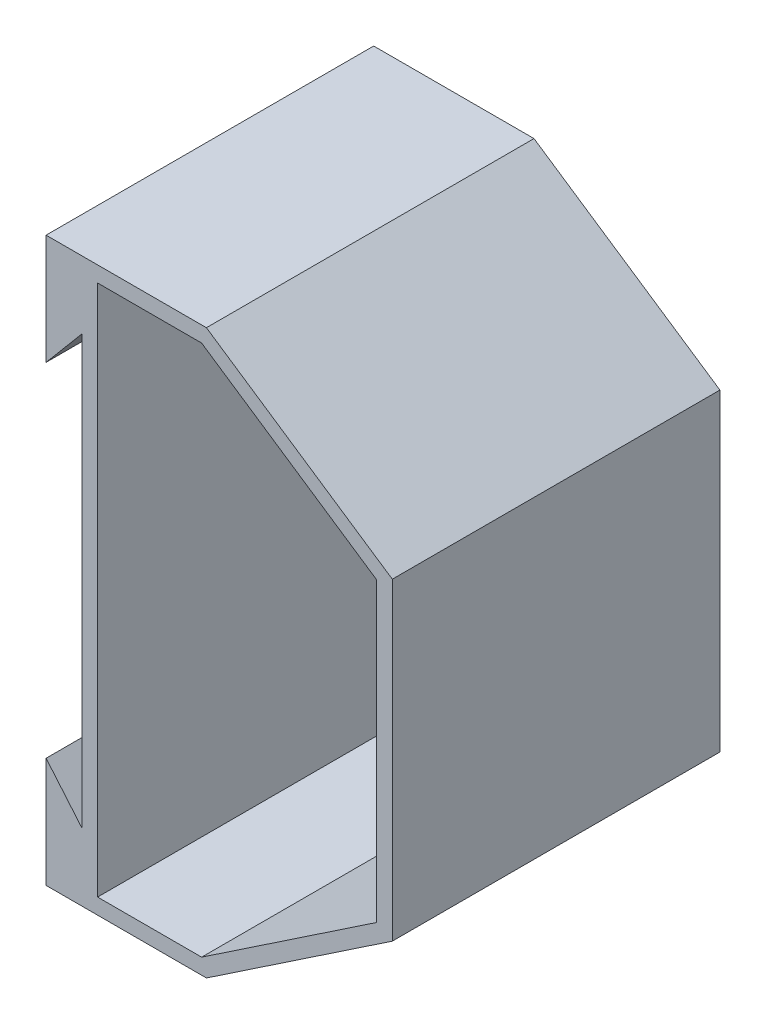
ISO-10303-21;
HEADER;
FILE_DESCRIPTION(('STEP AP214'),'2;1');
FILE_NAME('part.step','',(''),(''),'','','');
FILE_SCHEMA(('AUTOMOTIVE_DESIGN { 1 0 10303 214 1 1 1 1 }'));
ENDSEC;
DATA;
#1=APPLICATION_CONTEXT('core data for automotive mechanical design processes');
#2=APPLICATION_PROTOCOL_DEFINITION('international standard','automotive_design',2000,#1);
#3=PRODUCT_CONTEXT('',#1,'mechanical');
#4=PRODUCT('Part','Part','',(#3));
#5=PRODUCT_RELATED_PRODUCT_CATEGORY('part','',(#4));
#6=PRODUCT_DEFINITION_FORMATION('','',#4);
#7=PRODUCT_DEFINITION_CONTEXT('part definition',#1,'design');
#8=PRODUCT_DEFINITION('design','',#6,#7);
#9=PRODUCT_DEFINITION_SHAPE('','',#8);
#10=(LENGTH_UNIT() NAMED_UNIT(*) SI_UNIT(.MILLI.,.METRE.));
#11=(NAMED_UNIT(*) PLANE_ANGLE_UNIT() SI_UNIT($,.RADIAN.));
#12=(NAMED_UNIT(*) SI_UNIT($,.STERADIAN.) SOLID_ANGLE_UNIT());
#13=UNCERTAINTY_MEASURE_WITH_UNIT(LENGTH_MEASURE(1.E-05),#10,'distance_accuracy_value','');
#14=(GEOMETRIC_REPRESENTATION_CONTEXT(3) GLOBAL_UNCERTAINTY_ASSIGNED_CONTEXT((#13)) GLOBAL_UNIT_ASSIGNED_CONTEXT((#10,
#11,#12)) REPRESENTATION_CONTEXT('',''));
#15=CARTESIAN_POINT('',(0.,0.,0.));
#16=DIRECTION('',(0.,0.,1.));
#17=DIRECTION('',(1.,0.,0.));
#18=AXIS2_PLACEMENT_3D('',#15,#16,#17);
#19=CARTESIAN_POINT('',(0.,0.,73.15));
#20=DIRECTION('',(0.,0.,-1.));
#21=DIRECTION('',(-1.,0.,0.));
#22=AXIS2_PLACEMENT_3D('',#19,#20,#21);
#23=PLANE('',#22);
#24=DIRECTION('',(0.,1.,0.));
#25=VECTOR('',#24,1.);
#26=CARTESIAN_POINT('',(154.617693897145,70.,73.15));
#27=LINE('',#26,#25);
#28=CARTESIAN_POINT('',(154.617693897145,-70.,73.15));
#29=VERTEX_POINT('',#28);
#30=CARTESIAN_POINT('',(154.617693897145,70.,73.15));
#31=VERTEX_POINT('',#30);
#32=EDGE_CURVE('E205',#29,#31,#27,.T.);
#33=ORIENTED_EDGE('',*,*,#32,.T.);
#34=DIRECTION('',(-0.830176938971446,0.5575,0.));
#35=VECTOR('',#34,1.);
#36=CARTESIAN_POINT('',(154.617693897145,70.,73.15));
#37=LINE('',#36,#35);
#38=CARTESIAN_POINT('',(71.6,125.75,73.15));
#39=VERTEX_POINT('',#38);
#40=EDGE_CURVE('E208',#31,#39,#37,.T.);
#41=ORIENTED_EDGE('',*,*,#40,.T.);
#42=DIRECTION('',(-1.,0.,0.));
#43=VECTOR('',#42,1.);
#44=CARTESIAN_POINT('',(71.6,125.75,73.15));
#45=LINE('',#44,#43);
#46=CARTESIAN_POINT('',(0.,125.75,73.15));
#47=VERTEX_POINT('',#46);
#48=EDGE_CURVE('E211',#39,#47,#45,.T.);
#49=ORIENTED_EDGE('',*,*,#48,.T.);
#50=DIRECTION('',(0.,-1.,0.));
#51=VECTOR('',#50,1.);
#52=CARTESIAN_POINT('',(0.,125.75,73.15));
#53=LINE('',#52,#51);
#54=CARTESIAN_POINT('',(0.,76.55,73.15));
#55=VERTEX_POINT('',#54);
#56=EDGE_CURVE('E213',#47,#55,#53,.T.);
#57=ORIENTED_EDGE('',*,*,#56,.T.);
#58=DIRECTION('',(0.64413574578278,0.764911198117051,0.));
#59=VECTOR('',#58,1.);
#60=CARTESIAN_POINT('',(0.,76.55,73.15));
#61=LINE('',#60,#59);
#62=CARTESIAN_POINT('',(16.,95.55,73.15));
#63=VERTEX_POINT('',#62);
#64=EDGE_CURVE('E215',#55,#63,#61,.T.);
#65=ORIENTED_EDGE('',*,*,#64,.T.);
#66=DIRECTION('',(0.,-1.,0.));
#67=VECTOR('',#66,1.);
#68=CARTESIAN_POINT('',(16.,95.55,73.15));
#69=LINE('',#68,#67);
#70=CARTESIAN_POINT('',(16.,-95.55,73.15));
#71=VERTEX_POINT('',#70);
#72=EDGE_CURVE('E217',#63,#71,#69,.T.);
#73=ORIENTED_EDGE('',*,*,#72,.T.);
#74=DIRECTION('',(-0.64413574578278,0.764911198117051,0.));
#75=VECTOR('',#74,1.);
#76=CARTESIAN_POINT('',(0.,-76.55,73.15));
#77=LINE('',#76,#75);
#78=CARTESIAN_POINT('',(0.,-76.55,73.15));
#79=VERTEX_POINT('',#78);
#80=EDGE_CURVE('E219',#71,#79,#77,.T.);
#81=ORIENTED_EDGE('',*,*,#80,.T.);
#82=DIRECTION('',(0.,-1.,0.));
#83=VECTOR('',#82,1.);
#84=CARTESIAN_POINT('',(0.,-125.75,73.15));
#85=LINE('',#84,#83);
#86=CARTESIAN_POINT('',(0.,-125.75,73.15));
#87=VERTEX_POINT('',#86);
#88=EDGE_CURVE('E221',#79,#87,#85,.T.);
#89=ORIENTED_EDGE('',*,*,#88,.T.);
#90=DIRECTION('',(1.,0.,0.));
#91=VECTOR('',#90,1.);
#92=CARTESIAN_POINT('',(71.6,-125.75,73.15));
#93=LINE('',#92,#91);
#94=CARTESIAN_POINT('',(71.6,-125.75,73.15));
#95=VERTEX_POINT('',#94);
#96=EDGE_CURVE('E223',#87,#95,#93,.T.);
#97=ORIENTED_EDGE('',*,*,#96,.T.);
#98=DIRECTION('',(0.830176938971446,0.5575,0.));
#99=VECTOR('',#98,1.);
#100=CARTESIAN_POINT('',(154.617693897145,-70.,73.15));
#101=LINE('',#100,#99);
#102=EDGE_CURVE('E225',#95,#29,#101,.T.);
#103=ORIENTED_EDGE('',*,*,#102,.T.);
#104=EDGE_LOOP('',(#33,#41,#49,#57,#65,#73,#81,#89,#97,#103));
#105=FACE_BOUND('',#104,.T.);
#106=DIRECTION('',(0.,1.,0.));
#107=VECTOR('',#106,1.);
#108=CARTESIAN_POINT('',(147.617693897145,66.268867690016,73.15));
#109=LINE('',#108,#107);
#110=CARTESIAN_POINT('',(147.617693897145,-66.268867690016,73.15));
#111=VERTEX_POINT('',#110);
#112=CARTESIAN_POINT('',(147.617693897145,66.268867690016,73.15));
#113=VERTEX_POINT('',#112);
#114=EDGE_CURVE('E154',#111,#113,#109,.T.);
#115=ORIENTED_EDGE('',*,*,#114,.F.);
#116=DIRECTION('',(0.830176938971446,0.5575,0.));
#117=VECTOR('',#116,1.);
#118=CARTESIAN_POINT('',(147.617693897145,-66.268867690016,73.15));
#119=LINE('',#118,#117);
#120=CARTESIAN_POINT('',(69.4676925072648,-118.75,73.15));
#121=VERTEX_POINT('',#120);
#122=EDGE_CURVE('E183',#121,#111,#119,.T.);
#123=ORIENTED_EDGE('',*,*,#122,.F.);
#124=DIRECTION('',(1.,0.,0.));
#125=VECTOR('',#124,1.);
#126=CARTESIAN_POINT('',(69.4676925072648,-118.75,73.15));
#127=LINE('',#126,#125);
#128=CARTESIAN_POINT('',(23.,-118.75,73.15));
#129=VERTEX_POINT('',#128);
#130=EDGE_CURVE('E181',#129,#121,#127,.T.);
#131=ORIENTED_EDGE('',*,*,#130,.F.);
#132=DIRECTION('',(0.,-1.,0.));
#133=VECTOR('',#132,1.);
#134=CARTESIAN_POINT('',(23.,118.75,73.15));
#135=LINE('',#134,#133);
#136=CARTESIAN_POINT('',(23.,118.75,73.15));
#137=VERTEX_POINT('',#136);
#138=EDGE_CURVE('E177',#137,#129,#135,.T.);
#139=ORIENTED_EDGE('',*,*,#138,.F.);
#140=DIRECTION('',(-1.,0.,0.));
#141=VECTOR('',#140,1.);
#142=CARTESIAN_POINT('',(69.4676925072648,118.75,73.15));
#143=LINE('',#142,#141);
#144=CARTESIAN_POINT('',(69.4676925072648,118.75,73.15));
#145=VERTEX_POINT('',#144);
#146=EDGE_CURVE('E175',#145,#137,#143,.T.);
#147=ORIENTED_EDGE('',*,*,#146,.F.);
#148=DIRECTION('',(-0.830176938971446,0.5575,0.));
#149=VECTOR('',#148,1.);
#150=CARTESIAN_POINT('',(147.617693897145,66.268867690016,73.15));
#151=LINE('',#150,#149);
#152=EDGE_CURVE('E162',#113,#145,#151,.T.);
#153=ORIENTED_EDGE('',*,*,#152,.F.);
#154=EDGE_LOOP('',(#115,#123,#131,#139,#147,#153));
#155=FACE_BOUND('',#154,.T.);
#156=ADVANCED_FACE('F41',(#105,#155),#23,.F.);
#157=CARTESIAN_POINT('',(0.,0.,-73.15));
#158=DIRECTION('',(0.,0.,-1.));
#159=DIRECTION('',(-1.,0.,0.));
#160=AXIS2_PLACEMENT_3D('',#157,#158,#159);
#161=PLANE('',#160);
#162=DIRECTION('',(0.,1.,0.));
#163=VECTOR('',#162,1.);
#164=CARTESIAN_POINT('',(154.617693897145,70.,-73.15));
#165=LINE('',#164,#163);
#166=CARTESIAN_POINT('',(154.617693897145,-70.,-73.15));
#167=VERTEX_POINT('',#166);
#168=CARTESIAN_POINT('',(154.617693897145,70.,-73.15));
#169=VERTEX_POINT('',#168);
#170=EDGE_CURVE('E170',#167,#169,#165,.T.);
#171=ORIENTED_EDGE('',*,*,#170,.F.);
#172=DIRECTION('',(0.830176938971446,0.5575,0.));
#173=VECTOR('',#172,1.);
#174=CARTESIAN_POINT('',(154.617693897145,-70.,-73.15));
#175=LINE('',#174,#173);
#176=CARTESIAN_POINT('',(71.6,-125.75,-73.15));
#177=VERTEX_POINT('',#176);
#178=EDGE_CURVE('E209',#177,#167,#175,.T.);
#179=ORIENTED_EDGE('',*,*,#178,.F.);
#180=DIRECTION('',(1.,0.,0.));
#181=VECTOR('',#180,1.);
#182=CARTESIAN_POINT('',(71.6,-125.75,-73.15));
#183=LINE('',#182,#181);
#184=CARTESIAN_POINT('',(0.,-125.75,-73.15));
#185=VERTEX_POINT('',#184);
#186=EDGE_CURVE('E244',#185,#177,#183,.T.);
#187=ORIENTED_EDGE('',*,*,#186,.F.);
#188=DIRECTION('',(0.,-1.,0.));
#189=VECTOR('',#188,1.);
#190=CARTESIAN_POINT('',(0.,-125.75,-73.15));
#191=LINE('',#190,#189);
#192=CARTESIAN_POINT('',(0.,-76.55,-73.15));
#193=VERTEX_POINT('',#192);
#194=EDGE_CURVE('E242',#193,#185,#191,.T.);
#195=ORIENTED_EDGE('',*,*,#194,.F.);
#196=DIRECTION('',(-0.64413574578278,0.764911198117051,0.));
#197=VECTOR('',#196,1.);
#198=CARTESIAN_POINT('',(0.,-76.55,-73.15));
#199=LINE('',#198,#197);
#200=CARTESIAN_POINT('',(16.,-95.55,-73.15));
#201=VERTEX_POINT('',#200);
#202=EDGE_CURVE('E240',#201,#193,#199,.T.);
#203=ORIENTED_EDGE('',*,*,#202,.F.);
#204=DIRECTION('',(0.,-1.,0.));
#205=VECTOR('',#204,1.);
#206=CARTESIAN_POINT('',(16.,95.55,-73.15));
#207=LINE('',#206,#205);
#208=CARTESIAN_POINT('',(16.,95.55,-73.15));
#209=VERTEX_POINT('',#208);
#210=EDGE_CURVE('E238',#209,#201,#207,.T.);
#211=ORIENTED_EDGE('',*,*,#210,.F.);
#212=DIRECTION('',(0.64413574578278,0.764911198117051,0.));
#213=VECTOR('',#212,1.);
#214=CARTESIAN_POINT('',(0.,76.55,-73.15));
#215=LINE('',#214,#213);
#216=CARTESIAN_POINT('',(0.,76.55,-73.15));
#217=VERTEX_POINT('',#216);
#218=EDGE_CURVE('E236',#217,#209,#215,.T.);
#219=ORIENTED_EDGE('',*,*,#218,.F.);
#220=DIRECTION('',(0.,-1.,0.));
#221=VECTOR('',#220,1.);
#222=CARTESIAN_POINT('',(0.,125.75,-73.15));
#223=LINE('',#222,#221);
#224=CARTESIAN_POINT('',(0.,125.75,-73.15));
#225=VERTEX_POINT('',#224);
#226=EDGE_CURVE('E234',#225,#217,#223,.T.);
#227=ORIENTED_EDGE('',*,*,#226,.F.);
#228=DIRECTION('',(-1.,0.,0.));
#229=VECTOR('',#228,1.);
#230=CARTESIAN_POINT('',(71.6,125.75,-73.15));
#231=LINE('',#230,#229);
#232=CARTESIAN_POINT('',(71.6,125.75,-73.15));
#233=VERTEX_POINT('',#232);
#234=EDGE_CURVE('E232',#233,#225,#231,.T.);
#235=ORIENTED_EDGE('',*,*,#234,.F.);
#236=DIRECTION('',(-0.830176938971446,0.5575,0.));
#237=VECTOR('',#236,1.);
#238=CARTESIAN_POINT('',(154.617693897145,70.,-73.15));
#239=LINE('',#238,#237);
#240=EDGE_CURVE('E230',#169,#233,#239,.T.);
#241=ORIENTED_EDGE('',*,*,#240,.F.);
#242=EDGE_LOOP('',(#171,#179,#187,#195,#203,#211,#219,#227,#235,#241));
#243=FACE_BOUND('',#242,.T.);
#244=DIRECTION('',(0.830176938971446,0.5575,0.));
#245=VECTOR('',#244,1.);
#246=CARTESIAN_POINT('',(147.617693897145,-66.268867690016,-73.15));
#247=LINE('',#246,#245);
#248=CARTESIAN_POINT('',(69.4676925072648,-118.75,-73.15));
#249=VERTEX_POINT('',#248);
#250=CARTESIAN_POINT('',(147.617693897145,-66.268867690016,-73.15));
#251=VERTEX_POINT('',#250);
#252=EDGE_CURVE('E163',#249,#251,#247,.T.);
#253=ORIENTED_EDGE('',*,*,#252,.T.);
#254=DIRECTION('',(0.,1.,0.));
#255=VECTOR('',#254,1.);
#256=CARTESIAN_POINT('',(147.617693897145,66.268867690016,-73.15));
#257=LINE('',#256,#255);
#258=CARTESIAN_POINT('',(147.617693897145,66.268867690016,-73.15));
#259=VERTEX_POINT('',#258);
#260=EDGE_CURVE('E64',#251,#259,#257,.T.);
#261=ORIENTED_EDGE('',*,*,#260,.T.);
#262=DIRECTION('',(-0.830176938971446,0.5575,0.));
#263=VECTOR('',#262,1.);
#264=CARTESIAN_POINT('',(147.617693897145,66.268867690016,-73.15));
#265=LINE('',#264,#263);
#266=CARTESIAN_POINT('',(69.4676925072648,118.75,-73.15));
#267=VERTEX_POINT('',#266);
#268=EDGE_CURVE('E169',#259,#267,#265,.T.);
#269=ORIENTED_EDGE('',*,*,#268,.T.);
#270=DIRECTION('',(-1.,0.,0.));
#271=VECTOR('',#270,1.);
#272=CARTESIAN_POINT('',(69.4676925072648,118.75,-73.15));
#273=LINE('',#272,#271);
#274=CARTESIAN_POINT('',(23.,118.75,-73.15));
#275=VERTEX_POINT('',#274);
#276=EDGE_CURVE('E187',#267,#275,#273,.T.);
#277=ORIENTED_EDGE('',*,*,#276,.T.);
#278=DIRECTION('',(0.,-1.,0.));
#279=VECTOR('',#278,1.);
#280=CARTESIAN_POINT('',(23.,118.75,-73.15));
#281=LINE('',#280,#279);
#282=CARTESIAN_POINT('',(23.,-118.75,-73.15));
#283=VERTEX_POINT('',#282);
#284=EDGE_CURVE('E190',#275,#283,#281,.T.);
#285=ORIENTED_EDGE('',*,*,#284,.T.);
#286=DIRECTION('',(1.,0.,0.));
#287=VECTOR('',#286,1.);
#288=CARTESIAN_POINT('',(69.4676925072648,-118.75,-73.15));
#289=LINE('',#288,#287);
#290=EDGE_CURVE('E193',#283,#249,#289,.T.);
#291=ORIENTED_EDGE('',*,*,#290,.T.);
#292=EDGE_LOOP('',(#253,#261,#269,#277,#285,#291));
#293=FACE_BOUND('',#292,.T.);
#294=ADVANCED_FACE('F280',(#243,#293),#161,.T.);
#295=CARTESIAN_POINT('',(154.617693897145,70.,73.15));
#296=DIRECTION('',(-1.,0.,0.));
#297=DIRECTION('',(0.,0.,1.));
#298=AXIS2_PLACEMENT_3D('',#295,#296,#297);
#299=PLANE('',#298);
#300=ORIENTED_EDGE('',*,*,#170,.T.);
#301=DIRECTION('',(0.,0.,-1.));
#302=VECTOR('',#301,1.);
#303=CARTESIAN_POINT('',(154.617693897145,70.,73.15));
#304=LINE('',#303,#302);
#305=EDGE_CURVE('E11',#31,#169,#304,.T.);
#306=ORIENTED_EDGE('',*,*,#305,.F.);
#307=ORIENTED_EDGE('',*,*,#32,.F.);
#308=DIRECTION('',(0.,0.,-1.));
#309=VECTOR('',#308,1.);
#310=CARTESIAN_POINT('',(154.617693897145,-70.,73.15));
#311=LINE('',#310,#309);
#312=EDGE_CURVE('E227',#29,#167,#311,.T.);
#313=ORIENTED_EDGE('',*,*,#312,.T.);
#314=EDGE_LOOP('',(#300,#306,#307,#313));
#315=FACE_BOUND('',#314,.T.);
#316=ADVANCED_FACE('F43',(#315),#299,.F.);
#317=CARTESIAN_POINT('',(154.617693897145,70.,73.15));
#318=DIRECTION('',(-0.5575,-0.830176938971446,0.));
#319=DIRECTION('',(0.830176938971446,-0.5575,0.));
#320=AXIS2_PLACEMENT_3D('',#317,#318,#319);
#321=PLANE('',#320);
#322=ORIENTED_EDGE('',*,*,#240,.T.);
#323=DIRECTION('',(0.,0.,-1.));
#324=VECTOR('',#323,1.);
#325=CARTESIAN_POINT('',(71.6,125.75,73.15));
#326=LINE('',#325,#324);
#327=EDGE_CURVE('E49',#39,#233,#326,.T.);
#328=ORIENTED_EDGE('',*,*,#327,.F.);
#329=ORIENTED_EDGE('',*,*,#40,.F.);
#330=ORIENTED_EDGE('',*,*,#305,.T.);
#331=EDGE_LOOP('',(#322,#328,#329,#330));
#332=FACE_BOUND('',#331,.T.);
#333=ADVANCED_FACE('F297',(#332),#321,.F.);
#334=CARTESIAN_POINT('',(71.6,125.75,73.15));
#335=DIRECTION('',(0.,-1.,0.));
#336=DIRECTION('',(1.,0.,0.));
#337=AXIS2_PLACEMENT_3D('',#334,#335,#336);
#338=PLANE('',#337);
#339=ORIENTED_EDGE('',*,*,#234,.T.);
#340=DIRECTION('',(0.,0.,-1.));
#341=VECTOR('',#340,1.);
#342=CARTESIAN_POINT('',(0.,125.75,73.15));
#343=LINE('',#342,#341);
#344=EDGE_CURVE('E267',#47,#225,#343,.T.);
#345=ORIENTED_EDGE('',*,*,#344,.F.);
#346=ORIENTED_EDGE('',*,*,#48,.F.);
#347=ORIENTED_EDGE('',*,*,#327,.T.);
#348=EDGE_LOOP('',(#339,#345,#346,#347));
#349=FACE_BOUND('',#348,.T.);
#350=ADVANCED_FACE('F274',(#349),#338,.F.);
#351=CARTESIAN_POINT('',(0.,125.75,73.15));
#352=DIRECTION('',(1.,0.,0.));
#353=DIRECTION('',(0.,1.,0.));
#354=AXIS2_PLACEMENT_3D('',#351,#352,#353);
#355=PLANE('',#354);
#356=ORIENTED_EDGE('',*,*,#226,.T.);
#357=DIRECTION('',(0.,0.,-1.));
#358=VECTOR('',#357,1.);
#359=CARTESIAN_POINT('',(0.,76.55,73.15));
#360=LINE('',#359,#358);
#361=EDGE_CURVE('E264',#55,#217,#360,.T.);
#362=ORIENTED_EDGE('',*,*,#361,.F.);
#363=ORIENTED_EDGE('',*,*,#56,.F.);
#364=ORIENTED_EDGE('',*,*,#344,.T.);
#365=EDGE_LOOP('',(#356,#362,#363,#364));
#366=FACE_BOUND('',#365,.T.);
#367=ADVANCED_FACE('F286',(#366),#355,.F.);
#368=CARTESIAN_POINT('',(0.,76.55,73.15));
#369=DIRECTION('',(-0.764911198117051,0.64413574578278,0.));
#370=DIRECTION('',(-0.64413574578278,-0.764911198117051,0.));
#371=AXIS2_PLACEMENT_3D('',#368,#369,#370);
#372=PLANE('',#371);
#373=ORIENTED_EDGE('',*,*,#218,.T.);
#374=DIRECTION('',(0.,0.,-1.));
#375=VECTOR('',#374,1.);
#376=CARTESIAN_POINT('',(16.,95.55,73.15));
#377=LINE('',#376,#375);
#378=EDGE_CURVE('E261',#63,#209,#377,.T.);
#379=ORIENTED_EDGE('',*,*,#378,.F.);
#380=ORIENTED_EDGE('',*,*,#64,.F.);
#381=ORIENTED_EDGE('',*,*,#361,.T.);
#382=EDGE_LOOP('',(#373,#379,#380,#381));
#383=FACE_BOUND('',#382,.T.);
#384=ADVANCED_FACE('F290',(#383),#372,.F.);
#385=CARTESIAN_POINT('',(16.,95.55,73.15));
#386=DIRECTION('',(1.,0.,0.));
#387=DIRECTION('',(0.,0.,-1.));
#388=AXIS2_PLACEMENT_3D('',#385,#386,#387);
#389=PLANE('',#388);
#390=ORIENTED_EDGE('',*,*,#210,.T.);
#391=DIRECTION('',(0.,0.,-1.));
#392=VECTOR('',#391,1.);
#393=CARTESIAN_POINT('',(16.,-95.55,73.15));
#394=LINE('',#393,#392);
#395=EDGE_CURVE('E258',#71,#201,#394,.T.);
#396=ORIENTED_EDGE('',*,*,#395,.F.);
#397=ORIENTED_EDGE('',*,*,#72,.F.);
#398=ORIENTED_EDGE('',*,*,#378,.T.);
#399=EDGE_LOOP('',(#390,#396,#397,#398));
#400=FACE_BOUND('',#399,.T.);
#401=ADVANCED_FACE('F320',(#400),#389,.F.);
#402=CARTESIAN_POINT('',(0.,-76.55,73.15));
#403=DIRECTION('',(-0.764911198117051,-0.64413574578278,0.));
#404=DIRECTION('',(0.64413574578278,-0.764911198117051,0.));
#405=AXIS2_PLACEMENT_3D('',#402,#403,#404);
#406=PLANE('',#405);
#407=ORIENTED_EDGE('',*,*,#202,.T.);
#408=DIRECTION('',(0.,0.,-1.));
#409=VECTOR('',#408,1.);
#410=CARTESIAN_POINT('',(0.,-76.55,73.15));
#411=LINE('',#410,#409);
#412=EDGE_CURVE('E255',#79,#193,#411,.T.);
#413=ORIENTED_EDGE('',*,*,#412,.F.);
#414=ORIENTED_EDGE('',*,*,#80,.F.);
#415=ORIENTED_EDGE('',*,*,#395,.T.);
#416=EDGE_LOOP('',(#407,#413,#414,#415));
#417=FACE_BOUND('',#416,.T.);
#418=ADVANCED_FACE('F317',(#417),#406,.F.);
#419=CARTESIAN_POINT('',(0.,-125.75,73.15));
#420=DIRECTION('',(1.,0.,0.));
#421=DIRECTION('',(0.,1.,0.));
#422=AXIS2_PLACEMENT_3D('',#419,#420,#421);
#423=PLANE('',#422);
#424=ORIENTED_EDGE('',*,*,#194,.T.);
#425=DIRECTION('',(0.,0.,-1.));
#426=VECTOR('',#425,1.);
#427=CARTESIAN_POINT('',(0.,-125.75,73.15));
#428=LINE('',#427,#426);
#429=EDGE_CURVE('E252',#87,#185,#428,.T.);
#430=ORIENTED_EDGE('',*,*,#429,.F.);
#431=ORIENTED_EDGE('',*,*,#88,.F.);
#432=ORIENTED_EDGE('',*,*,#412,.T.);
#433=EDGE_LOOP('',(#424,#430,#431,#432));
#434=FACE_BOUND('',#433,.T.);
#435=ADVANCED_FACE('F313',(#434),#423,.F.);
#436=CARTESIAN_POINT('',(71.6,-125.75,73.15));
#437=DIRECTION('',(0.,1.,0.));
#438=DIRECTION('',(-1.,0.,0.));
#439=AXIS2_PLACEMENT_3D('',#436,#437,#438);
#440=PLANE('',#439);
#441=ORIENTED_EDGE('',*,*,#186,.T.);
#442=DIRECTION('',(0.,0.,-1.));
#443=VECTOR('',#442,1.);
#444=CARTESIAN_POINT('',(71.6,-125.75,73.15));
#445=LINE('',#444,#443);
#446=EDGE_CURVE('E249',#95,#177,#445,.T.);
#447=ORIENTED_EDGE('',*,*,#446,.F.);
#448=ORIENTED_EDGE('',*,*,#96,.F.);
#449=ORIENTED_EDGE('',*,*,#429,.T.);
#450=EDGE_LOOP('',(#441,#447,#448,#449));
#451=FACE_BOUND('',#450,.T.);
#452=ADVANCED_FACE('F309',(#451),#440,.F.);
#453=CARTESIAN_POINT('',(154.617693897145,-70.,73.15));
#454=DIRECTION('',(-0.5575,0.830176938971446,0.));
#455=DIRECTION('',(-0.830176938971446,-0.5575,0.));
#456=AXIS2_PLACEMENT_3D('',#453,#454,#455);
#457=PLANE('',#456);
#458=ORIENTED_EDGE('',*,*,#178,.T.);
#459=ORIENTED_EDGE('',*,*,#312,.F.);
#460=ORIENTED_EDGE('',*,*,#102,.F.);
#461=ORIENTED_EDGE('',*,*,#446,.T.);
#462=EDGE_LOOP('',(#458,#459,#460,#461));
#463=FACE_BOUND('',#462,.T.);
#464=ADVANCED_FACE('F304',(#463),#457,.F.);
#465=CARTESIAN_POINT('',(147.617693897145,66.268867690016,73.15));
#466=DIRECTION('',(-1.,0.,0.));
#467=DIRECTION('',(0.,-1.,0.));
#468=AXIS2_PLACEMENT_3D('',#465,#466,#467);
#469=PLANE('',#468);
#470=ORIENTED_EDGE('',*,*,#260,.F.);
#471=DIRECTION('',(0.,0.,-1.));
#472=VECTOR('',#471,1.);
#473=CARTESIAN_POINT('',(147.617693897145,-66.268867690016,73.15));
#474=LINE('',#473,#472);
#475=EDGE_CURVE('E158',#111,#251,#474,.T.);
#476=ORIENTED_EDGE('',*,*,#475,.F.);
#477=ORIENTED_EDGE('',*,*,#114,.T.);
#478=DIRECTION('',(0.,0.,-1.));
#479=VECTOR('',#478,1.);
#480=CARTESIAN_POINT('',(147.617693897145,66.268867690016,73.15));
#481=LINE('',#480,#479);
#482=EDGE_CURVE('E157',#113,#259,#481,.T.);
#483=ORIENTED_EDGE('',*,*,#482,.T.);
#484=EDGE_LOOP('',(#470,#476,#477,#483));
#485=FACE_BOUND('',#484,.T.);
#486=ADVANCED_FACE('F156',(#485),#469,.T.);
#487=CARTESIAN_POINT('',(147.617693897145,66.268867690016,73.15));
#488=DIRECTION('',(-0.5575,-0.830176938971446,0.));
#489=DIRECTION('',(0.830176938971446,-0.5575,0.));
#490=AXIS2_PLACEMENT_3D('',#487,#488,#489);
#491=PLANE('',#490);
#492=ORIENTED_EDGE('',*,*,#268,.F.);
#493=ORIENTED_EDGE('',*,*,#482,.F.);
#494=ORIENTED_EDGE('',*,*,#152,.T.);
#495=DIRECTION('',(0.,0.,-1.));
#496=VECTOR('',#495,1.);
#497=CARTESIAN_POINT('',(69.4676925072648,118.75,73.15));
#498=LINE('',#497,#496);
#499=EDGE_CURVE('E171',#145,#267,#498,.T.);
#500=ORIENTED_EDGE('',*,*,#499,.T.);
#501=EDGE_LOOP('',(#492,#493,#494,#500));
#502=FACE_BOUND('',#501,.T.);
#503=ADVANCED_FACE('F166',(#502),#491,.T.);
#504=CARTESIAN_POINT('',(69.4676925072648,118.75,73.15));
#505=DIRECTION('',(0.,-1.,0.));
#506=DIRECTION('',(1.,0.,0.));
#507=AXIS2_PLACEMENT_3D('',#504,#505,#506);
#508=PLANE('',#507);
#509=ORIENTED_EDGE('',*,*,#276,.F.);
#510=ORIENTED_EDGE('',*,*,#499,.F.);
#511=ORIENTED_EDGE('',*,*,#146,.T.);
#512=DIRECTION('',(0.,0.,-1.));
#513=VECTOR('',#512,1.);
#514=CARTESIAN_POINT('',(23.,118.75,73.15));
#515=LINE('',#514,#513);
#516=EDGE_CURVE('E202',#137,#275,#515,.T.);
#517=ORIENTED_EDGE('',*,*,#516,.T.);
#518=EDGE_LOOP('',(#509,#510,#511,#517));
#519=FACE_BOUND('',#518,.T.);
#520=ADVANCED_FACE('F366',(#519),#508,.T.);
#521=CARTESIAN_POINT('',(23.,118.75,73.15));
#522=DIRECTION('',(1.,0.,0.));
#523=DIRECTION('',(0.,1.,0.));
#524=AXIS2_PLACEMENT_3D('',#521,#522,#523);
#525=PLANE('',#524);
#526=ORIENTED_EDGE('',*,*,#284,.F.);
#527=ORIENTED_EDGE('',*,*,#516,.F.);
#528=ORIENTED_EDGE('',*,*,#138,.T.);
#529=DIRECTION('',(0.,0.,-1.));
#530=VECTOR('',#529,1.);
#531=CARTESIAN_POINT('',(23.,-118.75,73.15));
#532=LINE('',#531,#530);
#533=EDGE_CURVE('E200',#129,#283,#532,.T.);
#534=ORIENTED_EDGE('',*,*,#533,.T.);
#535=EDGE_LOOP('',(#526,#527,#528,#534));
#536=FACE_BOUND('',#535,.T.);
#537=ADVANCED_FACE('F372',(#536),#525,.T.);
#538=CARTESIAN_POINT('',(69.4676925072648,-118.75,73.15));
#539=DIRECTION('',(0.,1.,0.));
#540=DIRECTION('',(-1.,0.,0.));
#541=AXIS2_PLACEMENT_3D('',#538,#539,#540);
#542=PLANE('',#541);
#543=ORIENTED_EDGE('',*,*,#290,.F.);
#544=ORIENTED_EDGE('',*,*,#533,.F.);
#545=ORIENTED_EDGE('',*,*,#130,.T.);
#546=DIRECTION('',(0.,0.,-1.));
#547=VECTOR('',#546,1.);
#548=CARTESIAN_POINT('',(69.4676925072648,-118.75,73.15));
#549=LINE('',#548,#547);
#550=EDGE_CURVE('E56',#121,#249,#549,.T.);
#551=ORIENTED_EDGE('',*,*,#550,.T.);
#552=EDGE_LOOP('',(#543,#544,#545,#551));
#553=FACE_BOUND('',#552,.T.);
#554=ADVANCED_FACE('F380',(#553),#542,.T.);
#555=CARTESIAN_POINT('',(147.617693897145,-66.268867690016,73.15));
#556=DIRECTION('',(-0.5575,0.830176938971446,0.));
#557=DIRECTION('',(-0.830176938971446,-0.5575,0.));
#558=AXIS2_PLACEMENT_3D('',#555,#556,#557);
#559=PLANE('',#558);
#560=ORIENTED_EDGE('',*,*,#252,.F.);
#561=ORIENTED_EDGE('',*,*,#550,.F.);
#562=ORIENTED_EDGE('',*,*,#122,.T.);
#563=ORIENTED_EDGE('',*,*,#475,.T.);
#564=EDGE_LOOP('',(#560,#561,#562,#563));
#565=FACE_BOUND('',#564,.T.);
#566=ADVANCED_FACE('F388',(#565),#559,.T.);
#567=CLOSED_SHELL('',(#156,#294,#316,#333,#350,#367,#384,#401,#418,#435,#452,#464,#486,#503,
#520,#537,#554,#566));
#568=MANIFOLD_SOLID_BREP('B2',#567);
#569=ADVANCED_BREP_SHAPE_REPRESENTATION('',(#18,#568),#14);
#570=SHAPE_DEFINITION_REPRESENTATION(#9,#569);
ENDSEC;
END-ISO-10303-21;
